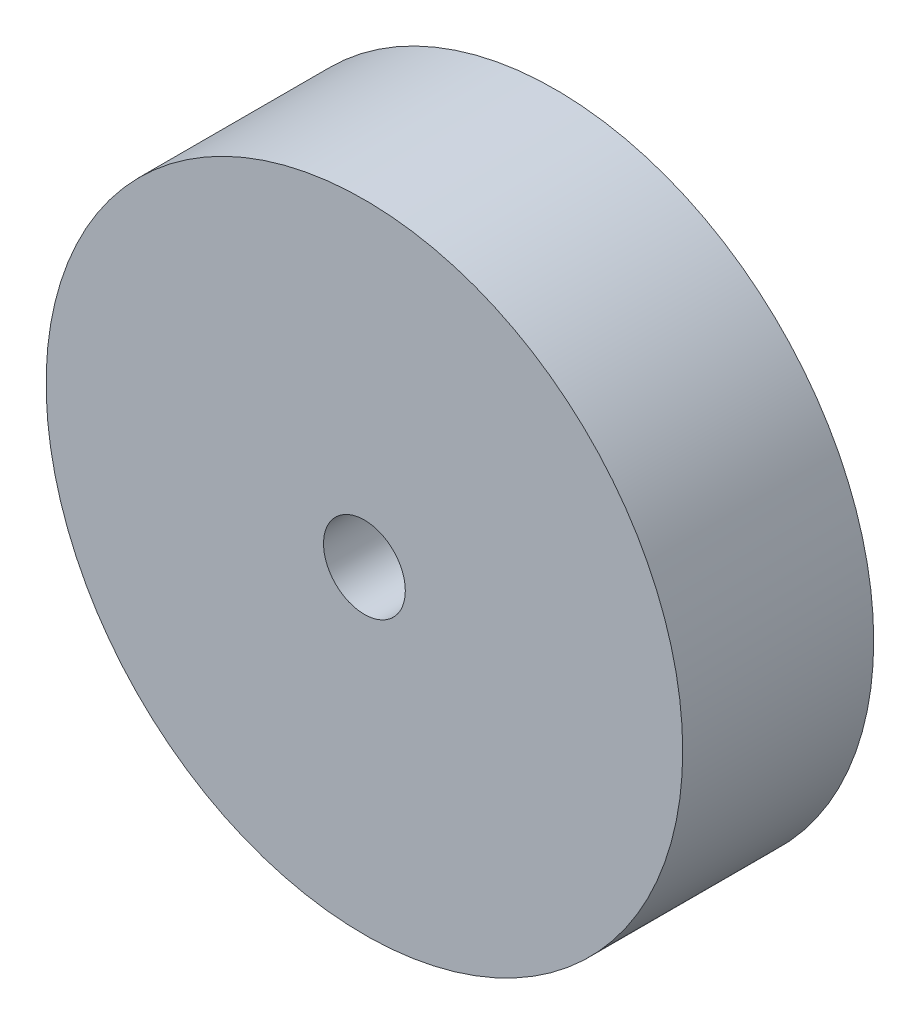
ISO-10303-21;
HEADER;
FILE_DESCRIPTION(('STEP AP214'),'2;1');
FILE_NAME('part.step','',(''),(''),'','','');
FILE_SCHEMA(('AUTOMOTIVE_DESIGN { 1 0 10303 214 1 1 1 1 }'));
ENDSEC;
DATA;
#1=APPLICATION_CONTEXT('core data for automotive mechanical design processes');
#2=APPLICATION_PROTOCOL_DEFINITION('international standard','automotive_design',2000,#1);
#3=PRODUCT_CONTEXT('',#1,'mechanical');
#4=PRODUCT('Part','Part','',(#3));
#5=PRODUCT_RELATED_PRODUCT_CATEGORY('part','',(#4));
#6=PRODUCT_DEFINITION_FORMATION('','',#4);
#7=PRODUCT_DEFINITION_CONTEXT('part definition',#1,'design');
#8=PRODUCT_DEFINITION('design','',#6,#7);
#9=PRODUCT_DEFINITION_SHAPE('','',#8);
#10=(LENGTH_UNIT() NAMED_UNIT(*) SI_UNIT(.MILLI.,.METRE.));
#11=(NAMED_UNIT(*) PLANE_ANGLE_UNIT() SI_UNIT($,.RADIAN.));
#12=(NAMED_UNIT(*) SI_UNIT($,.STERADIAN.) SOLID_ANGLE_UNIT());
#13=UNCERTAINTY_MEASURE_WITH_UNIT(LENGTH_MEASURE(1.E-05),#10,'distance_accuracy_value','');
#14=(GEOMETRIC_REPRESENTATION_CONTEXT(3) GLOBAL_UNCERTAINTY_ASSIGNED_CONTEXT((#13)) GLOBAL_UNIT_ASSIGNED_CONTEXT((#10,
#11,#12)) REPRESENTATION_CONTEXT('',''));
#15=CARTESIAN_POINT('',(0.,0.,0.));
#16=DIRECTION('',(0.,0.,1.));
#17=DIRECTION('',(1.,0.,0.));
#18=AXIS2_PLACEMENT_3D('',#15,#16,#17);
#19=CARTESIAN_POINT('',(0.,0.,7.61999999999999));
#20=DIRECTION('',(0.,0.,-0.999999999999999));
#21=DIRECTION('',(-1.,0.,0.));
#22=AXIS2_PLACEMENT_3D('',#19,#20,#21);
#23=CYLINDRICAL_SURFACE('',#22,12.7);
#24=CARTESIAN_POINT('',(0.,0.,7.61999999999999));
#25=DIRECTION('',(0.,0.,0.999999999999999));
#26=DIRECTION('',(1.,0.,0.));
#27=AXIS2_PLACEMENT_3D('',#24,#25,#26);
#28=CIRCLE('',#27,12.7);
#29=CARTESIAN_POINT('',(12.7,0.,7.61999999999999));
#30=VERTEX_POINT('',#29);
#31=EDGE_CURVE('E12',#30,#30,#28,.T.);
#32=ORIENTED_EDGE('',*,*,#31,.F.);
#33=EDGE_LOOP('',(#32));
#34=FACE_BOUND('',#33,.T.);
#35=CARTESIAN_POINT('',(0.,0.,0.));
#36=DIRECTION('',(0.,0.,0.999999999999999));
#37=DIRECTION('',(1.,0.,0.));
#38=AXIS2_PLACEMENT_3D('',#35,#36,#37);
#39=CIRCLE('',#38,12.7);
#40=CARTESIAN_POINT('',(12.7,0.,0.));
#41=VERTEX_POINT('',#40);
#42=EDGE_CURVE('E49',#41,#41,#39,.T.);
#43=ORIENTED_EDGE('',*,*,#42,.T.);
#44=EDGE_LOOP('',(#43));
#45=FACE_BOUND('',#44,.T.);
#46=ADVANCED_FACE('F46',(#34,#45),#23,.T.);
#47=CARTESIAN_POINT('',(0.,0.,7.61999999999999));
#48=DIRECTION('',(0.,0.,0.999999999999999));
#49=DIRECTION('',(1.,0.,0.));
#50=AXIS2_PLACEMENT_3D('',#47,#48,#49);
#51=PLANE('',#50);
#52=CARTESIAN_POINT('',(0.,0.,7.62));
#53=DIRECTION('',(0.,0.,0.999999999999999));
#54=DIRECTION('',(1.,0.,0.));
#55=AXIS2_PLACEMENT_3D('',#52,#53,#54);
#56=CIRCLE('',#55,1.63194999999999);
#57=CARTESIAN_POINT('',(1.63194999999999,0.,7.62));
#58=VERTEX_POINT('',#57);
#59=EDGE_CURVE('E60',#58,#58,#56,.T.);
#60=ORIENTED_EDGE('',*,*,#59,.F.);
#61=EDGE_LOOP('',(#60));
#62=FACE_BOUND('',#61,.T.);
#63=ORIENTED_EDGE('',*,*,#31,.T.);
#64=EDGE_LOOP('',(#63));
#65=FACE_BOUND('',#64,.T.);
#66=ADVANCED_FACE('F66',(#62,#65),#51,.T.);
#67=CARTESIAN_POINT('',(0.,0.,0.));
#68=DIRECTION('',(0.,0.,0.999999999999999));
#69=DIRECTION('',(1.,0.,0.));
#70=AXIS2_PLACEMENT_3D('',#67,#68,#69);
#71=PLANE('',#70);
#72=CARTESIAN_POINT('',(0.,0.,0.));
#73=DIRECTION('',(0.,0.,0.999999999999999));
#74=DIRECTION('',(1.,0.,0.));
#75=AXIS2_PLACEMENT_3D('',#72,#73,#74);
#76=CIRCLE('',#75,1.63195);
#77=CARTESIAN_POINT('',(1.63195,0.,0.));
#78=VERTEX_POINT('',#77);
#79=EDGE_CURVE('E56',#78,#78,#76,.T.);
#80=ORIENTED_EDGE('',*,*,#79,.T.);
#81=EDGE_LOOP('',(#80));
#82=FACE_BOUND('',#81,.T.);
#83=ORIENTED_EDGE('',*,*,#42,.F.);
#84=EDGE_LOOP('',(#83));
#85=FACE_BOUND('',#84,.T.);
#86=ADVANCED_FACE('F68',(#82,#85),#71,.F.);
#87=CARTESIAN_POINT('',(0.,0.,7.61999999999999));
#88=DIRECTION('',(0.,0.,0.999999999999999));
#89=DIRECTION('',(1.,0.,0.));
#90=AXIS2_PLACEMENT_3D('',#87,#88,#89);
#91=CYLINDRICAL_SURFACE('',#90,1.63194999999999);
#92=ORIENTED_EDGE('',*,*,#79,.F.);
#93=EDGE_LOOP('',(#92));
#94=FACE_BOUND('',#93,.T.);
#95=ORIENTED_EDGE('',*,*,#59,.T.);
#96=EDGE_LOOP('',(#95));
#97=FACE_BOUND('',#96,.T.);
#98=ADVANCED_FACE('F64',(#94,#97),#91,.F.);
#99=CLOSED_SHELL('',(#46,#66,#86,#98));
#100=MANIFOLD_SOLID_BREP('B2',#99);
#101=ADVANCED_BREP_SHAPE_REPRESENTATION('',(#18,#100),#14);
#102=SHAPE_DEFINITION_REPRESENTATION(#9,#101);
ENDSEC;
END-ISO-10303-21;
